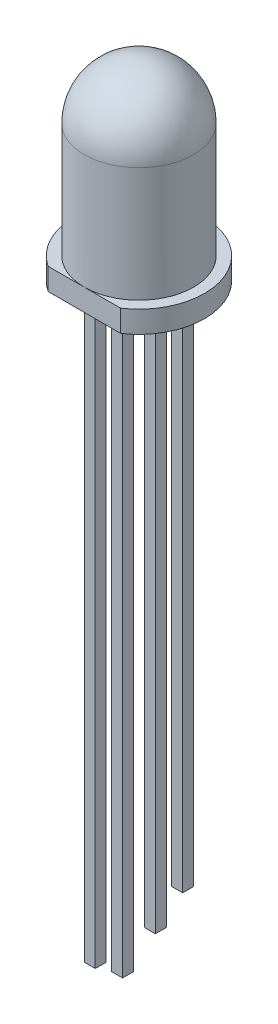
ISO-10303-21;
HEADER;
FILE_DESCRIPTION(('STEP AP214'),'2;1');
FILE_NAME('part.step','',(''),(''),'','','');
FILE_SCHEMA(('AUTOMOTIVE_DESIGN { 1 0 10303 214 1 1 1 1 }'));
ENDSEC;
DATA;
#1=APPLICATION_CONTEXT('core data for automotive mechanical design processes');
#2=APPLICATION_PROTOCOL_DEFINITION('international standard','automotive_design',2000,#1);
#3=PRODUCT_CONTEXT('',#1,'mechanical');
#4=PRODUCT('Part','Part','',(#3));
#5=PRODUCT_RELATED_PRODUCT_CATEGORY('part','',(#4));
#6=PRODUCT_DEFINITION_FORMATION('','',#4);
#7=PRODUCT_DEFINITION_CONTEXT('part definition',#1,'design');
#8=PRODUCT_DEFINITION('design','',#6,#7);
#9=PRODUCT_DEFINITION_SHAPE('','',#8);
#10=(LENGTH_UNIT() NAMED_UNIT(*) SI_UNIT(.MILLI.,.METRE.));
#11=(NAMED_UNIT(*) PLANE_ANGLE_UNIT() SI_UNIT($,.RADIAN.));
#12=(NAMED_UNIT(*) SI_UNIT($,.STERADIAN.) SOLID_ANGLE_UNIT());
#13=UNCERTAINTY_MEASURE_WITH_UNIT(LENGTH_MEASURE(1.E-05),#10,'distance_accuracy_value','');
#14=(GEOMETRIC_REPRESENTATION_CONTEXT(3) GLOBAL_UNCERTAINTY_ASSIGNED_CONTEXT((#13)) GLOBAL_UNIT_ASSIGNED_CONTEXT((#10,
#11,#12)) REPRESENTATION_CONTEXT('',''));
#15=CARTESIAN_POINT('',(0.,0.,0.));
#16=DIRECTION('',(0.,0.,1.));
#17=DIRECTION('',(1.,0.,0.));
#18=AXIS2_PLACEMENT_3D('',#15,#16,#17);
#19=CARTESIAN_POINT('',(0.25,-27.,2.25));
#20=DIRECTION('',(-1.,0.,0.));
#21=DIRECTION('',(0.,0.,1.));
#22=AXIS2_PLACEMENT_3D('',#19,#20,#21);
#23=PLANE('',#22);
#24=DIRECTION('',(0.,0.,1.));
#25=VECTOR('',#24,1.);
#26=CARTESIAN_POINT('',(0.25,-26.,2.25));
#27=LINE('',#26,#25);
#28=CARTESIAN_POINT('',(0.25,-26.,1.75));
#29=VERTEX_POINT('',#28);
#30=CARTESIAN_POINT('',(0.25,-26.,2.25));
#31=VERTEX_POINT('',#30);
#32=EDGE_CURVE('E366',#29,#31,#27,.T.);
#33=ORIENTED_EDGE('',*,*,#32,.F.);
#34=DIRECTION('',(0.,1.,0.));
#35=VECTOR('',#34,1.);
#36=CARTESIAN_POINT('',(0.25,-27.,1.75));
#37=LINE('',#36,#35);
#38=CARTESIAN_POINT('',(0.25,0.,1.75));
#39=VERTEX_POINT('',#38);
#40=EDGE_CURVE('E306',#29,#39,#37,.T.);
#41=ORIENTED_EDGE('',*,*,#40,.T.);
#42=DIRECTION('',(0.,0.,1.));
#43=VECTOR('',#42,1.);
#44=CARTESIAN_POINT('',(0.25,0.,2.25));
#45=LINE('',#44,#43);
#46=CARTESIAN_POINT('',(0.25,0.,2.25));
#47=VERTEX_POINT('',#46);
#48=EDGE_CURVE('E279',#39,#47,#45,.T.);
#49=ORIENTED_EDGE('',*,*,#48,.T.);
#50=DIRECTION('',(0.,1.,0.));
#51=VECTOR('',#50,1.);
#52=CARTESIAN_POINT('',(0.25,-27.,2.25));
#53=LINE('',#52,#51);
#54=EDGE_CURVE('E315',#31,#47,#53,.T.);
#55=ORIENTED_EDGE('',*,*,#54,.F.);
#56=EDGE_LOOP('',(#33,#41,#49,#55));
#57=FACE_BOUND('',#56,.T.);
#58=ADVANCED_FACE('F45',(#57),#23,.F.);
#59=CARTESIAN_POINT('',(-0.25,-27.,2.25));
#60=DIRECTION('',(0.,0.,-1.));
#61=DIRECTION('',(-1.,0.,0.));
#62=AXIS2_PLACEMENT_3D('',#59,#60,#61);
#63=PLANE('',#62);
#64=DIRECTION('',(-1.,0.,0.));
#65=VECTOR('',#64,1.);
#66=CARTESIAN_POINT('',(3.,-26.,2.25));
#67=LINE('',#66,#65);
#68=CARTESIAN_POINT('',(-0.25,-26.,2.25));
#69=VERTEX_POINT('',#68);
#70=EDGE_CURVE('E384',#31,#69,#67,.T.);
#71=ORIENTED_EDGE('',*,*,#70,.F.);
#72=ORIENTED_EDGE('',*,*,#54,.T.);
#73=DIRECTION('',(-1.,0.,0.));
#74=VECTOR('',#73,1.);
#75=CARTESIAN_POINT('',(-0.25,0.,2.25));
#76=LINE('',#75,#74);
#77=CARTESIAN_POINT('',(-0.25,0.,2.25));
#78=VERTEX_POINT('',#77);
#79=EDGE_CURVE('E294',#47,#78,#76,.T.);
#80=ORIENTED_EDGE('',*,*,#79,.T.);
#81=DIRECTION('',(0.,1.,0.));
#82=VECTOR('',#81,1.);
#83=CARTESIAN_POINT('',(-0.25,-27.,2.25));
#84=LINE('',#83,#82);
#85=EDGE_CURVE('E312',#69,#78,#84,.T.);
#86=ORIENTED_EDGE('',*,*,#85,.F.);
#87=EDGE_LOOP('',(#71,#72,#80,#86));
#88=FACE_BOUND('',#87,.T.);
#89=ADVANCED_FACE('F407',(#88),#63,.F.);
#90=CARTESIAN_POINT('',(-0.25,-27.,2.25));
#91=DIRECTION('',(1.,0.,0.));
#92=DIRECTION('',(0.,0.,-1.));
#93=AXIS2_PLACEMENT_3D('',#90,#91,#92);
#94=PLANE('',#93);
#95=DIRECTION('',(0.,0.,-1.));
#96=VECTOR('',#95,1.);
#97=CARTESIAN_POINT('',(-0.25,-26.,2.25));
#98=LINE('',#97,#96);
#99=CARTESIAN_POINT('',(-0.25,-26.,1.75));
#100=VERTEX_POINT('',#99);
#101=EDGE_CURVE('E69',#69,#100,#98,.T.);
#102=ORIENTED_EDGE('',*,*,#101,.F.);
#103=ORIENTED_EDGE('',*,*,#85,.T.);
#104=DIRECTION('',(0.,0.,-1.));
#105=VECTOR('',#104,1.);
#106=CARTESIAN_POINT('',(-0.25,0.,2.25));
#107=LINE('',#106,#105);
#108=CARTESIAN_POINT('',(-0.25,0.,1.75));
#109=VERTEX_POINT('',#108);
#110=EDGE_CURVE('E298',#78,#109,#107,.T.);
#111=ORIENTED_EDGE('',*,*,#110,.T.);
#112=DIRECTION('',(0.,1.,0.));
#113=VECTOR('',#112,1.);
#114=CARTESIAN_POINT('',(-0.25,-27.,1.75));
#115=LINE('',#114,#113);
#116=EDGE_CURVE('E309',#100,#109,#115,.T.);
#117=ORIENTED_EDGE('',*,*,#116,.F.);
#118=EDGE_LOOP('',(#102,#103,#111,#117));
#119=FACE_BOUND('',#118,.T.);
#120=ADVANCED_FACE('F414',(#119),#94,.F.);
#121=CARTESIAN_POINT('',(-0.25,-27.,1.75));
#122=DIRECTION('',(0.,0.,1.));
#123=DIRECTION('',(1.,0.,0.));
#124=AXIS2_PLACEMENT_3D('',#121,#122,#123);
#125=PLANE('',#124);
#126=DIRECTION('',(-1.,0.,0.));
#127=VECTOR('',#126,1.);
#128=CARTESIAN_POINT('',(3.,-26.,1.75));
#129=LINE('',#128,#127);
#130=EDGE_CURVE('E380',#29,#100,#129,.T.);
#131=ORIENTED_EDGE('',*,*,#130,.T.);
#132=ORIENTED_EDGE('',*,*,#116,.T.);
#133=DIRECTION('',(1.,0.,0.));
#134=VECTOR('',#133,1.);
#135=CARTESIAN_POINT('',(-0.25,0.,1.75));
#136=LINE('',#135,#134);
#137=EDGE_CURVE('E302',#109,#39,#136,.T.);
#138=ORIENTED_EDGE('',*,*,#137,.T.);
#139=ORIENTED_EDGE('',*,*,#40,.F.);
#140=EDGE_LOOP('',(#131,#132,#138,#139));
#141=FACE_BOUND('',#140,.T.);
#142=ADVANCED_FACE('F563',(#141),#125,.F.);
#143=CARTESIAN_POINT('',(0.25,-27.,-0.5));
#144=DIRECTION('',(-1.,0.,0.));
#145=DIRECTION('',(0.,0.,1.));
#146=AXIS2_PLACEMENT_3D('',#143,#144,#145);
#147=PLANE('',#146);
#148=DIRECTION('',(0.,0.,1.));
#149=VECTOR('',#148,1.);
#150=CARTESIAN_POINT('',(0.25,-26.,-0.5));
#151=LINE('',#150,#149);
#152=CARTESIAN_POINT('',(0.25,-26.,-1.));
#153=VERTEX_POINT('',#152);
#154=CARTESIAN_POINT('',(0.25,-26.,-0.5));
#155=VERTEX_POINT('',#154);
#156=EDGE_CURVE('E374',#153,#155,#151,.T.);
#157=ORIENTED_EDGE('',*,*,#156,.F.);
#158=DIRECTION('',(0.,1.,0.));
#159=VECTOR('',#158,1.);
#160=CARTESIAN_POINT('',(0.25,-27.,-1.));
#161=LINE('',#160,#159);
#162=CARTESIAN_POINT('',(0.25,0.,-1.));
#163=VERTEX_POINT('',#162);
#164=EDGE_CURVE('E226',#153,#163,#161,.T.);
#165=ORIENTED_EDGE('',*,*,#164,.T.);
#166=DIRECTION('',(0.,0.,1.));
#167=VECTOR('',#166,1.);
#168=CARTESIAN_POINT('',(0.25,0.,-0.5));
#169=LINE('',#168,#167);
#170=CARTESIAN_POINT('',(0.25,0.,-0.5));
#171=VERTEX_POINT('',#170);
#172=EDGE_CURVE('E241',#163,#171,#169,.T.);
#173=ORIENTED_EDGE('',*,*,#172,.T.);
#174=DIRECTION('',(0.,1.,0.));
#175=VECTOR('',#174,1.);
#176=CARTESIAN_POINT('',(0.25,-27.,-0.5));
#177=LINE('',#176,#175);
#178=EDGE_CURVE('E217',#155,#171,#177,.T.);
#179=ORIENTED_EDGE('',*,*,#178,.F.);
#180=EDGE_LOOP('',(#157,#165,#173,#179));
#181=FACE_BOUND('',#180,.T.);
#182=ADVANCED_FACE('F554',(#181),#147,.F.);
#183=CARTESIAN_POINT('',(-0.25,-27.,-0.5));
#184=DIRECTION('',(0.,0.,-1.));
#185=DIRECTION('',(-1.,0.,0.));
#186=AXIS2_PLACEMENT_3D('',#183,#184,#185);
#187=PLANE('',#186);
#188=DIRECTION('',(-1.,0.,0.));
#189=VECTOR('',#188,1.);
#190=CARTESIAN_POINT('',(3.,-26.,-0.5));
#191=LINE('',#190,#189);
#192=CARTESIAN_POINT('',(-0.25,-26.,-0.5));
#193=VERTEX_POINT('',#192);
#194=EDGE_CURVE('E381',#155,#193,#191,.T.);
#195=ORIENTED_EDGE('',*,*,#194,.F.);
#196=ORIENTED_EDGE('',*,*,#178,.T.);
#197=DIRECTION('',(-1.,0.,0.));
#198=VECTOR('',#197,1.);
#199=CARTESIAN_POINT('',(-0.25,0.,-0.5));
#200=LINE('',#199,#198);
#201=CARTESIAN_POINT('',(-0.25,0.,-0.5));
#202=VERTEX_POINT('',#201);
#203=EDGE_CURVE('E237',#171,#202,#200,.T.);
#204=ORIENTED_EDGE('',*,*,#203,.T.);
#205=DIRECTION('',(0.,1.,0.));
#206=VECTOR('',#205,1.);
#207=CARTESIAN_POINT('',(-0.25,-27.,-0.5));
#208=LINE('',#207,#206);
#209=EDGE_CURVE('E220',#193,#202,#208,.T.);
#210=ORIENTED_EDGE('',*,*,#209,.F.);
#211=EDGE_LOOP('',(#195,#196,#204,#210));
#212=FACE_BOUND('',#211,.T.);
#213=ADVANCED_FACE('F545',(#212),#187,.F.);
#214=CARTESIAN_POINT('',(-0.25,-27.,-0.5));
#215=DIRECTION('',(1.,0.,0.));
#216=DIRECTION('',(0.,0.,-1.));
#217=AXIS2_PLACEMENT_3D('',#214,#215,#216);
#218=PLANE('',#217);
#219=DIRECTION('',(0.,0.,-1.));
#220=VECTOR('',#219,1.);
#221=CARTESIAN_POINT('',(-0.25,-26.,-0.5));
#222=LINE('',#221,#220);
#223=CARTESIAN_POINT('',(-0.25,-26.,-1.));
#224=VERTEX_POINT('',#223);
#225=EDGE_CURVE('E377',#193,#224,#222,.T.);
#226=ORIENTED_EDGE('',*,*,#225,.F.);
#227=ORIENTED_EDGE('',*,*,#209,.T.);
#228=DIRECTION('',(0.,0.,-1.));
#229=VECTOR('',#228,1.);
#230=CARTESIAN_POINT('',(-0.25,0.,-0.5));
#231=LINE('',#230,#229);
#232=CARTESIAN_POINT('',(-0.25,0.,-1.));
#233=VERTEX_POINT('',#232);
#234=EDGE_CURVE('E233',#202,#233,#231,.T.);
#235=ORIENTED_EDGE('',*,*,#234,.T.);
#236=DIRECTION('',(0.,1.,0.));
#237=VECTOR('',#236,1.);
#238=CARTESIAN_POINT('',(-0.25,-27.,-1.));
#239=LINE('',#238,#237);
#240=EDGE_CURVE('E223',#224,#233,#239,.T.);
#241=ORIENTED_EDGE('',*,*,#240,.F.);
#242=EDGE_LOOP('',(#226,#227,#235,#241));
#243=FACE_BOUND('',#242,.T.);
#244=ADVANCED_FACE('F536',(#243),#218,.F.);
#245=CARTESIAN_POINT('',(-0.25,-27.,-1.));
#246=DIRECTION('',(0.,0.,1.));
#247=DIRECTION('',(1.,0.,0.));
#248=AXIS2_PLACEMENT_3D('',#245,#246,#247);
#249=PLANE('',#248);
#250=DIRECTION('',(-1.,0.,0.));
#251=VECTOR('',#250,1.);
#252=CARTESIAN_POINT('',(3.,-26.,-1.));
#253=LINE('',#252,#251);
#254=EDGE_CURVE('E190',#153,#224,#253,.T.);
#255=ORIENTED_EDGE('',*,*,#254,.T.);
#256=ORIENTED_EDGE('',*,*,#240,.T.);
#257=DIRECTION('',(1.,0.,0.));
#258=VECTOR('',#257,1.);
#259=CARTESIAN_POINT('',(-0.25,0.,-1.));
#260=LINE('',#259,#258);
#261=EDGE_CURVE('E229',#233,#163,#260,.T.);
#262=ORIENTED_EDGE('',*,*,#261,.T.);
#263=ORIENTED_EDGE('',*,*,#164,.F.);
#264=EDGE_LOOP('',(#255,#256,#262,#263));
#265=FACE_BOUND('',#264,.T.);
#266=ADVANCED_FACE('F357',(#265),#249,.F.);
#267=CARTESIAN_POINT('',(0.,0.,0.));
#268=DIRECTION('',(0.,1.,0.));
#269=DIRECTION('',(0.,0.,1.));
#270=AXIS2_PLACEMENT_3D('',#267,#268,#269);
#271=PLANE('',#270);
#272=ORIENTED_EDGE('',*,*,#172,.F.);
#273=ORIENTED_EDGE('',*,*,#261,.F.);
#274=ORIENTED_EDGE('',*,*,#234,.F.);
#275=ORIENTED_EDGE('',*,*,#203,.F.);
#276=EDGE_LOOP('',(#272,#273,#274,#275));
#277=FACE_BOUND('',#276,.T.);
#278=ORIENTED_EDGE('',*,*,#48,.F.);
#279=ORIENTED_EDGE('',*,*,#137,.F.);
#280=ORIENTED_EDGE('',*,*,#110,.F.);
#281=ORIENTED_EDGE('',*,*,#79,.F.);
#282=EDGE_LOOP('',(#278,#279,#280,#281));
#283=FACE_BOUND('',#282,.T.);
#284=DIRECTION('',(-1.,0.,0.));
#285=VECTOR('',#284,1.);
#286=CARTESIAN_POINT('',(-1.6583123951777,0.,2.5));
#287=LINE('',#286,#285);
#288=CARTESIAN_POINT('',(1.6583123951777,0.,2.5));
#289=VERTEX_POINT('',#288);
#290=CARTESIAN_POINT('',(-1.6583123951777,0.,2.5));
#291=VERTEX_POINT('',#290);
#292=EDGE_CURVE('E318',#289,#291,#287,.T.);
#293=ORIENTED_EDGE('',*,*,#292,.T.);
#294=CARTESIAN_POINT('',(0.,0.,0.));
#295=DIRECTION('',(0.,1.,0.));
#296=DIRECTION('',(0.,0.,1.));
#297=AXIS2_PLACEMENT_3D('',#294,#295,#296);
#298=CIRCLE('',#297,3.);
#299=EDGE_CURVE('E11',#289,#291,#298,.T.);
#300=ORIENTED_EDGE('',*,*,#299,.F.);
#301=EDGE_LOOP('',(#293,#300));
#302=FACE_BOUND('',#301,.T.);
#303=DIRECTION('',(0.,0.,1.));
#304=VECTOR('',#303,1.);
#305=CARTESIAN_POINT('',(0.25,0.,1.));
#306=LINE('',#305,#304);
#307=CARTESIAN_POINT('',(0.25,0.,0.5));
#308=VERTEX_POINT('',#307);
#309=CARTESIAN_POINT('',(0.25,0.,1.));
#310=VERTEX_POINT('',#309);
#311=EDGE_CURVE('E275',#308,#310,#306,.T.);
#312=ORIENTED_EDGE('',*,*,#311,.F.);
#313=DIRECTION('',(1.,0.,0.));
#314=VECTOR('',#313,1.);
#315=CARTESIAN_POINT('',(-0.25,0.,0.5));
#316=LINE('',#315,#314);
#317=CARTESIAN_POINT('',(-0.25,0.,0.5));
#318=VERTEX_POINT('',#317);
#319=EDGE_CURVE('E262',#318,#308,#316,.T.);
#320=ORIENTED_EDGE('',*,*,#319,.F.);
#321=DIRECTION('',(0.,0.,-1.));
#322=VECTOR('',#321,1.);
#323=CARTESIAN_POINT('',(-0.25,0.,1.));
#324=LINE('',#323,#322);
#325=CARTESIAN_POINT('',(-0.25,0.,1.));
#326=VERTEX_POINT('',#325);
#327=EDGE_CURVE('E266',#326,#318,#324,.T.);
#328=ORIENTED_EDGE('',*,*,#327,.F.);
#329=DIRECTION('',(-1.,0.,0.));
#330=VECTOR('',#329,1.);
#331=CARTESIAN_POINT('',(-0.25,0.,1.));
#332=LINE('',#331,#330);
#333=EDGE_CURVE('E271',#310,#326,#332,.T.);
#334=ORIENTED_EDGE('',*,*,#333,.F.);
#335=EDGE_LOOP('',(#312,#320,#328,#334));
#336=FACE_BOUND('',#335,.T.);
#337=DIRECTION('',(0.,0.,1.));
#338=VECTOR('',#337,1.);
#339=CARTESIAN_POINT('',(0.25,0.,-1.75));
#340=LINE('',#339,#338);
#341=CARTESIAN_POINT('',(0.25,0.,-2.25));
#342=VERTEX_POINT('',#341);
#343=CARTESIAN_POINT('',(0.25,0.,-1.75));
#344=VERTEX_POINT('',#343);
#345=EDGE_CURVE('E214',#342,#344,#340,.T.);
#346=ORIENTED_EDGE('',*,*,#345,.F.);
#347=DIRECTION('',(1.,0.,0.));
#348=VECTOR('',#347,1.);
#349=CARTESIAN_POINT('',(-0.25,0.,-2.25));
#350=LINE('',#349,#348);
#351=CARTESIAN_POINT('',(-0.25,0.,-2.25));
#352=VERTEX_POINT('',#351);
#353=EDGE_CURVE('E195',#352,#342,#350,.T.);
#354=ORIENTED_EDGE('',*,*,#353,.F.);
#355=DIRECTION('',(0.,0.,-1.));
#356=VECTOR('',#355,1.);
#357=CARTESIAN_POINT('',(-0.25,0.,-1.75));
#358=LINE('',#357,#356);
#359=CARTESIAN_POINT('',(-0.25,0.,-1.75));
#360=VERTEX_POINT('',#359);
#361=EDGE_CURVE('E201',#360,#352,#358,.T.);
#362=ORIENTED_EDGE('',*,*,#361,.F.);
#363=DIRECTION('',(-1.,0.,0.));
#364=VECTOR('',#363,1.);
#365=CARTESIAN_POINT('',(-0.25,0.,-1.75));
#366=LINE('',#365,#364);
#367=EDGE_CURVE('E210',#344,#360,#366,.T.);
#368=ORIENTED_EDGE('',*,*,#367,.F.);
#369=EDGE_LOOP('',(#346,#354,#362,#368));
#370=FACE_BOUND('',#369,.T.);
#371=ADVANCED_FACE('F47',(#277,#283,#302,#336,#370),#271,.F.);
#372=CARTESIAN_POINT('',(0.,8.75,0.));
#373=DIRECTION('',(0.,1.,0.));
#374=DIRECTION('',(0.,0.,1.));
#375=AXIS2_PLACEMENT_3D('',#372,#373,#374);
#376=CYLINDRICAL_SURFACE('',#375,3.);
#377=DIRECTION('',(0.,-1.,0.));
#378=VECTOR('',#377,1.);
#379=CARTESIAN_POINT('',(1.6583123951777,10.,2.5));
#380=LINE('',#379,#378);
#381=CARTESIAN_POINT('',(1.6583123951777,0.999999999999999,2.5));
#382=VERTEX_POINT('',#381);
#383=EDGE_CURVE('E325',#382,#289,#380,.T.);
#384=ORIENTED_EDGE('',*,*,#383,.T.);
#385=ORIENTED_EDGE('',*,*,#299,.T.);
#386=DIRECTION('',(0.,-1.,0.));
#387=VECTOR('',#386,1.);
#388=CARTESIAN_POINT('',(-1.6583123951777,10.,2.5));
#389=LINE('',#388,#387);
#390=CARTESIAN_POINT('',(-1.6583123951777,0.999999999999999,2.5));
#391=VERTEX_POINT('',#390);
#392=EDGE_CURVE('E322',#391,#291,#389,.T.);
#393=ORIENTED_EDGE('',*,*,#392,.F.);
#394=CARTESIAN_POINT('',(0.,1.,0.));
#395=DIRECTION('',(0.,1.,0.));
#396=DIRECTION('',(0.,0.,1.));
#397=AXIS2_PLACEMENT_3D('',#394,#395,#396);
#398=CIRCLE('',#397,3.);
#399=EDGE_CURVE('E54',#382,#391,#398,.T.);
#400=ORIENTED_EDGE('',*,*,#399,.F.);
#401=EDGE_LOOP('',(#384,#385,#393,#400));
#402=FACE_BOUND('',#401,.T.);
#403=ADVANCED_FACE('F350',(#402),#376,.T.);
#404=CARTESIAN_POINT('',(0.,1.,-3.));
#405=DIRECTION('',(0.,-1.,0.));
#406=DIRECTION('',(0.,0.,-1.));
#407=AXIS2_PLACEMENT_3D('',#404,#405,#406);
#408=PLANE('',#407);
#409=DIRECTION('',(-1.,0.,0.));
#410=VECTOR('',#409,1.);
#411=CARTESIAN_POINT('',(0.,1.,2.5));
#412=LINE('',#411,#410);
#413=CARTESIAN_POINT('',(0.,1.,2.5));
#414=VERTEX_POINT('',#413);
#415=EDGE_CURVE('E332',#382,#414,#412,.T.);
#416=ORIENTED_EDGE('',*,*,#415,.F.);
#417=ORIENTED_EDGE('',*,*,#399,.T.);
#418=EDGE_CURVE('E329',#414,#391,#412,.T.);
#419=ORIENTED_EDGE('',*,*,#418,.F.);
#420=CARTESIAN_POINT('',(0.,1.,0.));
#421=DIRECTION('',(0.,1.,0.));
#422=DIRECTION('',(0.,0.,1.));
#423=AXIS2_PLACEMENT_3D('',#420,#421,#422);
#424=CIRCLE('',#423,2.5);
#425=EDGE_CURVE('E337',#414,#414,#424,.T.);
#426=ORIENTED_EDGE('',*,*,#425,.F.);
#427=EDGE_LOOP('',(#416,#417,#419,#426));
#428=FACE_BOUND('',#427,.T.);
#429=ADVANCED_FACE('F346',(#428),#408,.F.);
#430=CARTESIAN_POINT('',(0.,8.75,0.));
#431=DIRECTION('',(0.,1.,0.));
#432=DIRECTION('',(0.,0.,1.));
#433=AXIS2_PLACEMENT_3D('',#430,#431,#432);
#434=CYLINDRICAL_SURFACE('',#433,2.5);
#435=CARTESIAN_POINT('',(0.,6.25,0.));
#436=DIRECTION('',(0.,1.,0.));
#437=DIRECTION('',(0.,0.,1.));
#438=AXIS2_PLACEMENT_3D('',#435,#436,#437);
#439=CIRCLE('',#438,2.5);
#440=CARTESIAN_POINT('',(0.,6.25,2.5));
#441=VERTEX_POINT('',#440);
#442=EDGE_CURVE('E333',#441,#441,#439,.T.);
#443=ORIENTED_EDGE('',*,*,#442,.F.);
#444=EDGE_LOOP('',(#443));
#445=FACE_BOUND('',#444,.T.);
#446=ORIENTED_EDGE('',*,*,#425,.T.);
#447=EDGE_LOOP('',(#446));
#448=FACE_BOUND('',#447,.T.);
#449=ADVANCED_FACE('F426',(#445,#448),#434,.T.);
#450=CARTESIAN_POINT('',(0.,6.25,0.));
#451=DIRECTION('',(0.,1.,0.));
#452=DIRECTION('',(0.,0.,-1.));
#453=AXIS2_PLACEMENT_3D('',#450,#451,#452);
#454=SPHERICAL_SURFACE('',#453,2.5);
#455=ORIENTED_EDGE('',*,*,#442,.T.);
#456=EDGE_LOOP('',(#455));
#457=FACE_BOUND('',#456,.T.);
#458=ADVANCED_FACE('F423',(#457),#454,.T.);
#459=CARTESIAN_POINT('',(-1.6583123951777,10.,2.5));
#460=DIRECTION('',(0.,0.,1.));
#461=DIRECTION('',(1.,0.,0.));
#462=AXIS2_PLACEMENT_3D('',#459,#460,#461);
#463=PLANE('',#462);
#464=ORIENTED_EDGE('',*,*,#415,.T.);
#465=ORIENTED_EDGE('',*,*,#418,.T.);
#466=ORIENTED_EDGE('',*,*,#392,.T.);
#467=ORIENTED_EDGE('',*,*,#292,.F.);
#468=ORIENTED_EDGE('',*,*,#383,.F.);
#469=EDGE_LOOP('',(#464,#465,#466,#467,#468));
#470=FACE_BOUND('',#469,.T.);
#471=ADVANCED_FACE('F353',(#470),#463,.T.);
#472=CARTESIAN_POINT('',(0.25,-27.,1.));
#473=DIRECTION('',(-1.,0.,0.));
#474=DIRECTION('',(0.,0.,1.));
#475=AXIS2_PLACEMENT_3D('',#472,#473,#474);
#476=PLANE('',#475);
#477=ORIENTED_EDGE('',*,*,#311,.T.);
#478=DIRECTION('',(0.,1.,0.));
#479=VECTOR('',#478,1.);
#480=CARTESIAN_POINT('',(0.25,-27.,1.));
#481=LINE('',#480,#479);
#482=CARTESIAN_POINT('',(0.25,-27.,1.));
#483=VERTEX_POINT('',#482);
#484=EDGE_CURVE('E245',#483,#310,#481,.T.);
#485=ORIENTED_EDGE('',*,*,#484,.F.);
#486=DIRECTION('',(0.,0.,1.));
#487=VECTOR('',#486,1.);
#488=CARTESIAN_POINT('',(0.25,-27.,1.));
#489=LINE('',#488,#487);
#490=CARTESIAN_POINT('',(0.25,-27.,0.5));
#491=VERTEX_POINT('',#490);
#492=EDGE_CURVE('E267',#491,#483,#489,.T.);
#493=ORIENTED_EDGE('',*,*,#492,.F.);
#494=DIRECTION('',(0.,1.,0.));
#495=VECTOR('',#494,1.);
#496=CARTESIAN_POINT('',(0.25,-27.,0.5));
#497=LINE('',#496,#495);
#498=EDGE_CURVE('E257',#491,#308,#497,.T.);
#499=ORIENTED_EDGE('',*,*,#498,.T.);
#500=EDGE_LOOP('',(#477,#485,#493,#499));
#501=FACE_BOUND('',#500,.T.);
#502=ADVANCED_FACE('F422',(#501),#476,.F.);
#503=CARTESIAN_POINT('',(-0.25,-27.,1.));
#504=DIRECTION('',(0.,0.,-1.));
#505=DIRECTION('',(-1.,0.,0.));
#506=AXIS2_PLACEMENT_3D('',#503,#504,#505);
#507=PLANE('',#506);
#508=ORIENTED_EDGE('',*,*,#333,.T.);
#509=DIRECTION('',(0.,1.,0.));
#510=VECTOR('',#509,1.);
#511=CARTESIAN_POINT('',(-0.25,-27.,1.));
#512=LINE('',#511,#510);
#513=CARTESIAN_POINT('',(-0.25,-27.,1.));
#514=VERTEX_POINT('',#513);
#515=EDGE_CURVE('E249',#514,#326,#512,.T.);
#516=ORIENTED_EDGE('',*,*,#515,.F.);
#517=DIRECTION('',(-1.,0.,0.));
#518=VECTOR('',#517,1.);
#519=CARTESIAN_POINT('',(-0.25,-27.,1.));
#520=LINE('',#519,#518);
#521=EDGE_CURVE('E285',#483,#514,#520,.T.);
#522=ORIENTED_EDGE('',*,*,#521,.F.);
#523=ORIENTED_EDGE('',*,*,#484,.T.);
#524=EDGE_LOOP('',(#508,#516,#522,#523));
#525=FACE_BOUND('',#524,.T.);
#526=ADVANCED_FACE('F465',(#525),#507,.F.);
#527=CARTESIAN_POINT('',(-0.25,-27.,1.));
#528=DIRECTION('',(1.,0.,0.));
#529=DIRECTION('',(0.,0.,-1.));
#530=AXIS2_PLACEMENT_3D('',#527,#528,#529);
#531=PLANE('',#530);
#532=ORIENTED_EDGE('',*,*,#327,.T.);
#533=DIRECTION('',(0.,1.,0.));
#534=VECTOR('',#533,1.);
#535=CARTESIAN_POINT('',(-0.25,-27.,0.5));
#536=LINE('',#535,#534);
#537=CARTESIAN_POINT('',(-0.25,-27.,0.5));
#538=VERTEX_POINT('',#537);
#539=EDGE_CURVE('E253',#538,#318,#536,.T.);
#540=ORIENTED_EDGE('',*,*,#539,.F.);
#541=DIRECTION('',(0.,0.,-1.));
#542=VECTOR('',#541,1.);
#543=CARTESIAN_POINT('',(-0.25,-27.,1.));
#544=LINE('',#543,#542);
#545=EDGE_CURVE('E282',#514,#538,#544,.T.);
#546=ORIENTED_EDGE('',*,*,#545,.F.);
#547=ORIENTED_EDGE('',*,*,#515,.T.);
#548=EDGE_LOOP('',(#532,#540,#546,#547));
#549=FACE_BOUND('',#548,.T.);
#550=ADVANCED_FACE('F473',(#549),#531,.F.);
#551=CARTESIAN_POINT('',(-0.25,-27.,0.5));
#552=DIRECTION('',(0.,0.,1.));
#553=DIRECTION('',(1.,0.,0.));
#554=AXIS2_PLACEMENT_3D('',#551,#552,#553);
#555=PLANE('',#554);
#556=ORIENTED_EDGE('',*,*,#319,.T.);
#557=ORIENTED_EDGE('',*,*,#498,.F.);
#558=DIRECTION('',(1.,0.,0.));
#559=VECTOR('',#558,1.);
#560=CARTESIAN_POINT('',(-0.25,-27.,0.5));
#561=LINE('',#560,#559);
#562=EDGE_CURVE('E261',#538,#491,#561,.T.);
#563=ORIENTED_EDGE('',*,*,#562,.F.);
#564=ORIENTED_EDGE('',*,*,#539,.T.);
#565=EDGE_LOOP('',(#556,#557,#563,#564));
#566=FACE_BOUND('',#565,.T.);
#567=ADVANCED_FACE('F482',(#566),#555,.F.);
#568=CARTESIAN_POINT('',(0.,-27.,0.));
#569=DIRECTION('',(0.,-1.,0.));
#570=DIRECTION('',(0.,0.,-1.));
#571=AXIS2_PLACEMENT_3D('',#568,#569,#570);
#572=PLANE('',#571);
#573=ORIENTED_EDGE('',*,*,#492,.T.);
#574=ORIENTED_EDGE('',*,*,#521,.T.);
#575=ORIENTED_EDGE('',*,*,#545,.T.);
#576=ORIENTED_EDGE('',*,*,#562,.T.);
#577=EDGE_LOOP('',(#573,#574,#575,#576));
#578=FACE_BOUND('',#577,.T.);
#579=ADVANCED_FACE('F490',(#578),#572,.T.);
#580=CARTESIAN_POINT('',(0.25,-27.,-1.75));
#581=DIRECTION('',(-1.,0.,0.));
#582=DIRECTION('',(0.,0.,1.));
#583=AXIS2_PLACEMENT_3D('',#580,#581,#582);
#584=PLANE('',#583);
#585=DIRECTION('',(0.,1.,0.));
#586=VECTOR('',#585,1.);
#587=CARTESIAN_POINT('',(0.25,-27.,-1.75));
#588=LINE('',#587,#586);
#589=CARTESIAN_POINT('',(0.25,-25.,-1.75));
#590=VERTEX_POINT('',#589);
#591=EDGE_CURVE('E188',#590,#344,#588,.T.);
#592=ORIENTED_EDGE('',*,*,#591,.F.);
#593=DIRECTION('',(0.,0.,-1.));
#594=VECTOR('',#593,1.);
#595=CARTESIAN_POINT('',(0.25,-25.,-1.75));
#596=LINE('',#595,#594);
#597=CARTESIAN_POINT('',(0.25,-25.,-2.25));
#598=VERTEX_POINT('',#597);
#599=EDGE_CURVE('E174',#590,#598,#596,.T.);
#600=ORIENTED_EDGE('',*,*,#599,.T.);
#601=DIRECTION('',(0.,1.,0.));
#602=VECTOR('',#601,1.);
#603=CARTESIAN_POINT('',(0.25,-27.,-2.25));
#604=LINE('',#603,#602);
#605=EDGE_CURVE('E186',#598,#342,#604,.T.);
#606=ORIENTED_EDGE('',*,*,#605,.T.);
#607=ORIENTED_EDGE('',*,*,#345,.T.);
#608=EDGE_LOOP('',(#592,#600,#606,#607));
#609=FACE_BOUND('',#608,.T.);
#610=ADVANCED_FACE('F184',(#609),#584,.F.);
#611=CARTESIAN_POINT('',(-0.25,-27.,-1.75));
#612=DIRECTION('',(0.,0.,-1.));
#613=DIRECTION('',(-1.,0.,0.));
#614=AXIS2_PLACEMENT_3D('',#611,#612,#613);
#615=PLANE('',#614);
#616=DIRECTION('',(0.,1.,0.));
#617=VECTOR('',#616,1.);
#618=CARTESIAN_POINT('',(-0.25,-27.,-1.75));
#619=LINE('',#618,#617);
#620=CARTESIAN_POINT('',(-0.25,-25.,-1.75));
#621=VERTEX_POINT('',#620);
#622=EDGE_CURVE('E203',#621,#360,#619,.T.);
#623=ORIENTED_EDGE('',*,*,#622,.F.);
#624=DIRECTION('',(1.,0.,0.));
#625=VECTOR('',#624,1.);
#626=CARTESIAN_POINT('',(-3.,-25.,-1.75));
#627=LINE('',#626,#625);
#628=EDGE_CURVE('E180',#621,#590,#627,.T.);
#629=ORIENTED_EDGE('',*,*,#628,.T.);
#630=ORIENTED_EDGE('',*,*,#591,.T.);
#631=ORIENTED_EDGE('',*,*,#367,.T.);
#632=EDGE_LOOP('',(#623,#629,#630,#631));
#633=FACE_BOUND('',#632,.T.);
#634=ADVANCED_FACE('F364',(#633),#615,.F.);
#635=CARTESIAN_POINT('',(-0.25,-27.,-1.75));
#636=DIRECTION('',(1.,0.,0.));
#637=DIRECTION('',(0.,0.,-1.));
#638=AXIS2_PLACEMENT_3D('',#635,#636,#637);
#639=PLANE('',#638);
#640=DIRECTION('',(0.,1.,0.));
#641=VECTOR('',#640,1.);
#642=CARTESIAN_POINT('',(-0.25,-27.,-2.25));
#643=LINE('',#642,#641);
#644=CARTESIAN_POINT('',(-0.25,-25.,-2.25));
#645=VERTEX_POINT('',#644);
#646=EDGE_CURVE('E197',#645,#352,#643,.T.);
#647=ORIENTED_EDGE('',*,*,#646,.F.);
#648=DIRECTION('',(0.,0.,1.));
#649=VECTOR('',#648,1.);
#650=CARTESIAN_POINT('',(-0.25,-25.,-1.75));
#651=LINE('',#650,#649);
#652=EDGE_CURVE('E61',#645,#621,#651,.T.);
#653=ORIENTED_EDGE('',*,*,#652,.T.);
#654=ORIENTED_EDGE('',*,*,#622,.T.);
#655=ORIENTED_EDGE('',*,*,#361,.T.);
#656=EDGE_LOOP('',(#647,#653,#654,#655));
#657=FACE_BOUND('',#656,.T.);
#658=ADVANCED_FACE('F396',(#657),#639,.F.);
#659=CARTESIAN_POINT('',(-0.25,-27.,-2.25));
#660=DIRECTION('',(0.,0.,1.));
#661=DIRECTION('',(1.,0.,0.));
#662=AXIS2_PLACEMENT_3D('',#659,#660,#661);
#663=PLANE('',#662);
#664=ORIENTED_EDGE('',*,*,#605,.F.);
#665=DIRECTION('',(1.,0.,0.));
#666=VECTOR('',#665,1.);
#667=CARTESIAN_POINT('',(-3.,-25.,-2.25));
#668=LINE('',#667,#666);
#669=EDGE_CURVE('E171',#645,#598,#668,.T.);
#670=ORIENTED_EDGE('',*,*,#669,.F.);
#671=ORIENTED_EDGE('',*,*,#646,.T.);
#672=ORIENTED_EDGE('',*,*,#353,.T.);
#673=EDGE_LOOP('',(#664,#670,#671,#672));
#674=FACE_BOUND('',#673,.T.);
#675=ADVANCED_FACE('F193',(#674),#663,.F.);
#676=CARTESIAN_POINT('',(3.,-26.,-0.5));
#677=DIRECTION('',(0.,-1.,0.));
#678=DIRECTION('',(0.,0.,-1.));
#679=AXIS2_PLACEMENT_3D('',#676,#677,#678);
#680=PLANE('',#679);
#681=ORIENTED_EDGE('',*,*,#156,.T.);
#682=ORIENTED_EDGE('',*,*,#194,.T.);
#683=ORIENTED_EDGE('',*,*,#225,.T.);
#684=ORIENTED_EDGE('',*,*,#254,.F.);
#685=EDGE_LOOP('',(#681,#682,#683,#684));
#686=FACE_BOUND('',#685,.T.);
#687=ADVANCED_FACE('F403',(#686),#680,.T.);
#688=CARTESIAN_POINT('',(3.,-26.,2.25));
#689=DIRECTION('',(0.,-1.,0.));
#690=DIRECTION('',(0.,0.,-1.));
#691=AXIS2_PLACEMENT_3D('',#688,#689,#690);
#692=PLANE('',#691);
#693=ORIENTED_EDGE('',*,*,#32,.T.);
#694=ORIENTED_EDGE('',*,*,#70,.T.);
#695=ORIENTED_EDGE('',*,*,#101,.T.);
#696=ORIENTED_EDGE('',*,*,#130,.F.);
#697=EDGE_LOOP('',(#693,#694,#695,#696));
#698=FACE_BOUND('',#697,.T.);
#699=ADVANCED_FACE('F596',(#698),#692,.T.);
#700=CARTESIAN_POINT('',(-3.,-25.,-1.75));
#701=DIRECTION('',(0.,1.,0.));
#702=DIRECTION('',(0.,0.,1.));
#703=AXIS2_PLACEMENT_3D('',#700,#701,#702);
#704=PLANE('',#703);
#705=ORIENTED_EDGE('',*,*,#628,.F.);
#706=ORIENTED_EDGE('',*,*,#652,.F.);
#707=ORIENTED_EDGE('',*,*,#669,.T.);
#708=ORIENTED_EDGE('',*,*,#599,.F.);
#709=EDGE_LOOP('',(#705,#706,#707,#708));
#710=FACE_BOUND('',#709,.T.);
#711=ADVANCED_FACE('F173',(#710),#704,.F.);
#712=CLOSED_SHELL('',(#58,#89,#120,#142,#182,#213,#244,#266,#371,#403,#429,#449,#458,#471,#502,
#526,#550,#567,#579,#610,#634,#658,#675,#687,#699,#711));
#713=MANIFOLD_SOLID_BREP('B2',#712);
#714=ADVANCED_BREP_SHAPE_REPRESENTATION('',(#18,#713),#14);
#715=SHAPE_DEFINITION_REPRESENTATION(#9,#714);
ENDSEC;
END-ISO-10303-21;
